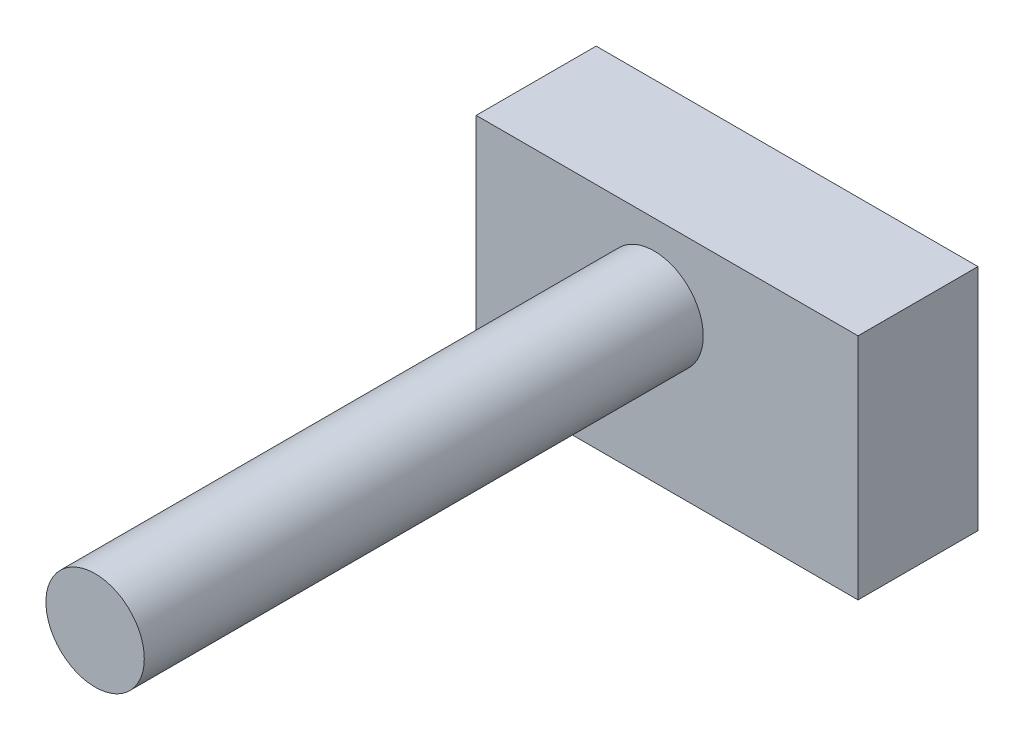
ISO-10303-21;
HEADER;
FILE_DESCRIPTION(('STEP AP214'),'2;1');
FILE_NAME('part.step','',(''),(''),'','','');
FILE_SCHEMA(('AUTOMOTIVE_DESIGN { 1 0 10303 214 1 1 1 1 }'));
ENDSEC;
DATA;
#1=APPLICATION_CONTEXT('core data for automotive mechanical design processes');
#2=APPLICATION_PROTOCOL_DEFINITION('international standard','automotive_design',2000,#1);
#3=PRODUCT_CONTEXT('',#1,'mechanical');
#4=PRODUCT('Part','Part','',(#3));
#5=PRODUCT_RELATED_PRODUCT_CATEGORY('part','',(#4));
#6=PRODUCT_DEFINITION_FORMATION('','',#4);
#7=PRODUCT_DEFINITION_CONTEXT('part definition',#1,'design');
#8=PRODUCT_DEFINITION('design','',#6,#7);
#9=PRODUCT_DEFINITION_SHAPE('','',#8);
#10=(LENGTH_UNIT() NAMED_UNIT(*) SI_UNIT(.MILLI.,.METRE.));
#11=(NAMED_UNIT(*) PLANE_ANGLE_UNIT() SI_UNIT($,.RADIAN.));
#12=(NAMED_UNIT(*) SI_UNIT($,.STERADIAN.) SOLID_ANGLE_UNIT());
#13=UNCERTAINTY_MEASURE_WITH_UNIT(LENGTH_MEASURE(1.E-05),#10,'distance_accuracy_value','');
#14=(GEOMETRIC_REPRESENTATION_CONTEXT(3) GLOBAL_UNCERTAINTY_ASSIGNED_CONTEXT((#13)) GLOBAL_UNIT_ASSIGNED_CONTEXT((#10,
#11,#12)) REPRESENTATION_CONTEXT('',''));
#15=CARTESIAN_POINT('',(0.,0.,0.));
#16=DIRECTION('',(0.,0.,1.));
#17=DIRECTION('',(1.,0.,0.));
#18=AXIS2_PLACEMENT_3D('',#15,#16,#17);
#19=CARTESIAN_POINT('',(80.8621553221599,-48.4364310379738,50.8));
#20=DIRECTION('',(-1.,0.,0.));
#21=DIRECTION('',(0.,0.,1.));
#22=AXIS2_PLACEMENT_3D('',#19,#20,#21);
#23=PLANE('',#22);
#24=DIRECTION('',(0.,1.,0.));
#25=VECTOR('',#24,1.);
#26=CARTESIAN_POINT('',(80.8621553221599,-48.4364310379738,0.));
#27=LINE('',#26,#25);
#28=CARTESIAN_POINT('',(80.8621553221599,-48.4364310379738,0.));
#29=VERTEX_POINT('',#28);
#30=CARTESIAN_POINT('',(80.8621553221599,48.4364310379738,0.));
#31=VERTEX_POINT('',#30);
#32=EDGE_CURVE('E101',#29,#31,#27,.T.);
#33=ORIENTED_EDGE('',*,*,#32,.T.);
#34=DIRECTION('',(0.,0.,-1.));
#35=VECTOR('',#34,1.);
#36=CARTESIAN_POINT('',(80.8621553221599,48.4364310379738,50.8));
#37=LINE('',#36,#35);
#38=CARTESIAN_POINT('',(80.8621553221599,48.4364310379738,50.8));
#39=VERTEX_POINT('',#38);
#40=EDGE_CURVE('E38',#39,#31,#37,.T.);
#41=ORIENTED_EDGE('',*,*,#40,.F.);
#42=DIRECTION('',(0.,1.,0.));
#43=VECTOR('',#42,1.);
#44=CARTESIAN_POINT('',(80.8621553221599,-48.4364310379738,50.8));
#45=LINE('',#44,#43);
#46=CARTESIAN_POINT('',(80.8621553221599,-48.4364310379738,50.8));
#47=VERTEX_POINT('',#46);
#48=EDGE_CURVE('E88',#47,#39,#45,.T.);
#49=ORIENTED_EDGE('',*,*,#48,.F.);
#50=DIRECTION('',(0.,0.,-1.));
#51=VECTOR('',#50,1.);
#52=CARTESIAN_POINT('',(80.8621553221599,-48.4364310379738,50.8));
#53=LINE('',#52,#51);
#54=EDGE_CURVE('E97',#47,#29,#53,.T.);
#55=ORIENTED_EDGE('',*,*,#54,.T.);
#56=EDGE_LOOP('',(#33,#41,#49,#55));
#57=FACE_BOUND('',#56,.T.);
#58=ADVANCED_FACE('F35',(#57),#23,.F.);
#59=CARTESIAN_POINT('',(-80.8621553221599,48.4364310379738,50.8));
#60=DIRECTION('',(0.,-1.,0.));
#61=DIRECTION('',(0.,0.,-1.));
#62=AXIS2_PLACEMENT_3D('',#59,#60,#61);
#63=PLANE('',#62);
#64=DIRECTION('',(-1.,0.,0.));
#65=VECTOR('',#64,1.);
#66=CARTESIAN_POINT('',(-80.8621553221599,48.4364310379738,0.));
#67=LINE('',#66,#65);
#68=CARTESIAN_POINT('',(-80.8621553221599,48.4364310379738,0.));
#69=VERTEX_POINT('',#68);
#70=EDGE_CURVE('E93',#31,#69,#67,.T.);
#71=ORIENTED_EDGE('',*,*,#70,.T.);
#72=DIRECTION('',(0.,0.,-1.));
#73=VECTOR('',#72,1.);
#74=CARTESIAN_POINT('',(-80.8621553221599,48.4364310379738,50.8));
#75=LINE('',#74,#73);
#76=CARTESIAN_POINT('',(-80.8621553221599,48.4364310379738,50.8));
#77=VERTEX_POINT('',#76);
#78=EDGE_CURVE('E91',#77,#69,#75,.T.);
#79=ORIENTED_EDGE('',*,*,#78,.F.);
#80=DIRECTION('',(-1.,0.,0.));
#81=VECTOR('',#80,1.);
#82=CARTESIAN_POINT('',(-80.8621553221599,48.4364310379738,50.8));
#83=LINE('',#82,#81);
#84=EDGE_CURVE('E83',#39,#77,#83,.T.);
#85=ORIENTED_EDGE('',*,*,#84,.F.);
#86=ORIENTED_EDGE('',*,*,#40,.T.);
#87=EDGE_LOOP('',(#71,#79,#85,#86));
#88=FACE_BOUND('',#87,.T.);
#89=ADVANCED_FACE('F92',(#88),#63,.F.);
#90=CARTESIAN_POINT('',(-80.8621553221599,-48.4364310379738,50.8));
#91=DIRECTION('',(1.,0.,0.));
#92=DIRECTION('',(0.,0.,-1.));
#93=AXIS2_PLACEMENT_3D('',#90,#91,#92);
#94=PLANE('',#93);
#95=DIRECTION('',(0.,-1.,0.));
#96=VECTOR('',#95,1.);
#97=CARTESIAN_POINT('',(-80.8621553221599,-48.4364310379738,0.));
#98=LINE('',#97,#96);
#99=CARTESIAN_POINT('',(-80.8621553221599,-48.4364310379738,0.));
#100=VERTEX_POINT('',#99);
#101=EDGE_CURVE('E69',#69,#100,#98,.T.);
#102=ORIENTED_EDGE('',*,*,#101,.T.);
#103=DIRECTION('',(0.,0.,-1.));
#104=VECTOR('',#103,1.);
#105=CARTESIAN_POINT('',(-80.8621553221599,-48.4364310379738,50.8));
#106=LINE('',#105,#104);
#107=CARTESIAN_POINT('',(-80.8621553221599,-48.4364310379738,50.8));
#108=VERTEX_POINT('',#107);
#109=EDGE_CURVE('E94',#108,#100,#106,.T.);
#110=ORIENTED_EDGE('',*,*,#109,.F.);
#111=DIRECTION('',(0.,-1.,0.));
#112=VECTOR('',#111,1.);
#113=CARTESIAN_POINT('',(-80.8621553221599,-48.4364310379738,50.8));
#114=LINE('',#113,#112);
#115=EDGE_CURVE('E86',#77,#108,#114,.T.);
#116=ORIENTED_EDGE('',*,*,#115,.F.);
#117=ORIENTED_EDGE('',*,*,#78,.T.);
#118=EDGE_LOOP('',(#102,#110,#116,#117));
#119=FACE_BOUND('',#118,.T.);
#120=ADVANCED_FACE('F95',(#119),#94,.F.);
#121=CARTESIAN_POINT('',(-80.8621553221599,-48.4364310379738,50.8));
#122=DIRECTION('',(0.,1.,0.));
#123=DIRECTION('',(0.,0.,1.));
#124=AXIS2_PLACEMENT_3D('',#121,#122,#123);
#125=PLANE('',#124);
#126=DIRECTION('',(1.,0.,0.));
#127=VECTOR('',#126,1.);
#128=CARTESIAN_POINT('',(-80.8621553221599,-48.4364310379738,0.));
#129=LINE('',#128,#127);
#130=EDGE_CURVE('E75',#100,#29,#129,.T.);
#131=ORIENTED_EDGE('',*,*,#130,.T.);
#132=ORIENTED_EDGE('',*,*,#54,.F.);
#133=DIRECTION('',(1.,0.,0.));
#134=VECTOR('',#133,1.);
#135=CARTESIAN_POINT('',(-80.8621553221599,-48.4364310379738,50.8));
#136=LINE('',#135,#134);
#137=EDGE_CURVE('E52',#108,#47,#136,.T.);
#138=ORIENTED_EDGE('',*,*,#137,.F.);
#139=ORIENTED_EDGE('',*,*,#109,.T.);
#140=EDGE_LOOP('',(#131,#132,#138,#139));
#141=FACE_BOUND('',#140,.T.);
#142=ADVANCED_FACE('F109',(#141),#125,.F.);
#143=CARTESIAN_POINT('',(0.,0.,50.8));
#144=DIRECTION('',(0.,0.,-1.));
#145=DIRECTION('',(-1.,0.,0.));
#146=AXIS2_PLACEMENT_3D('',#143,#144,#145);
#147=PLANE('',#146);
#148=CARTESIAN_POINT('',(-5.52569451349427,15.5604826372837,50.8));
#149=DIRECTION('',(0.,0.,1.));
#150=DIRECTION('',(1.,0.,0.));
#151=AXIS2_PLACEMENT_3D('',#148,#149,#150);
#152=CIRCLE('',#151,20.8310043615839);
#153=CARTESIAN_POINT('',(15.3053098480896,15.5604826372837,50.8));
#154=VERTEX_POINT('',#153);
#155=EDGE_CURVE('E11',#154,#154,#152,.T.);
#156=ORIENTED_EDGE('',*,*,#155,.F.);
#157=EDGE_LOOP('',(#156));
#158=FACE_BOUND('',#157,.T.);
#159=ORIENTED_EDGE('',*,*,#48,.T.);
#160=ORIENTED_EDGE('',*,*,#84,.T.);
#161=ORIENTED_EDGE('',*,*,#115,.T.);
#162=ORIENTED_EDGE('',*,*,#137,.T.);
#163=EDGE_LOOP('',(#159,#160,#161,#162));
#164=FACE_BOUND('',#163,.T.);
#165=ADVANCED_FACE('F84',(#158,#164),#147,.F.);
#166=CARTESIAN_POINT('',(0.,0.,0.));
#167=DIRECTION('',(0.,0.,-1.));
#168=DIRECTION('',(-1.,0.,0.));
#169=AXIS2_PLACEMENT_3D('',#166,#167,#168);
#170=PLANE('',#169);
#171=ORIENTED_EDGE('',*,*,#32,.F.);
#172=ORIENTED_EDGE('',*,*,#130,.F.);
#173=ORIENTED_EDGE('',*,*,#101,.F.);
#174=ORIENTED_EDGE('',*,*,#70,.F.);
#175=EDGE_LOOP('',(#171,#172,#173,#174));
#176=FACE_BOUND('',#175,.T.);
#177=ADVANCED_FACE('F112',(#176),#170,.T.);
#178=CARTESIAN_POINT('',(-5.52569451349427,15.5604826372837,287.528));
#179=DIRECTION('',(0.,0.,-1.));
#180=DIRECTION('',(-1.,0.,0.));
#181=AXIS2_PLACEMENT_3D('',#178,#179,#180);
#182=CYLINDRICAL_SURFACE('',#181,20.8310043615839);
#183=CARTESIAN_POINT('',(-5.52569451349427,15.5604826372837,287.528));
#184=DIRECTION('',(0.,0.,1.));
#185=DIRECTION('',(1.,0.,0.));
#186=AXIS2_PLACEMENT_3D('',#183,#184,#185);
#187=CIRCLE('',#186,20.8310043615839);
#188=CARTESIAN_POINT('',(15.3053098480896,15.5604826372837,287.528));
#189=VERTEX_POINT('',#188);
#190=EDGE_CURVE('E104',#189,#189,#187,.T.);
#191=ORIENTED_EDGE('',*,*,#190,.F.);
#192=EDGE_LOOP('',(#191));
#193=FACE_BOUND('',#192,.T.);
#194=ORIENTED_EDGE('',*,*,#155,.T.);
#195=EDGE_LOOP('',(#194));
#196=FACE_BOUND('',#195,.T.);
#197=ADVANCED_FACE('F120',(#193,#196),#182,.T.);
#198=CARTESIAN_POINT('',(-5.52569451349427,15.5604826372837,287.528));
#199=DIRECTION('',(0.,0.,1.));
#200=DIRECTION('',(1.,0.,0.));
#201=AXIS2_PLACEMENT_3D('',#198,#199,#200);
#202=PLANE('',#201);
#203=ORIENTED_EDGE('',*,*,#190,.T.);
#204=EDGE_LOOP('',(#203));
#205=FACE_BOUND('',#204,.T.);
#206=ADVANCED_FACE('F118',(#205),#202,.T.);
#207=CLOSED_SHELL('',(#58,#89,#120,#142,#165,#177,#197,#206));
#208=MANIFOLD_SOLID_BREP('B2',#207);
#209=ADVANCED_BREP_SHAPE_REPRESENTATION('',(#18,#208),#14);
#210=SHAPE_DEFINITION_REPRESENTATION(#9,#209);
ENDSEC;
END-ISO-10303-21;
